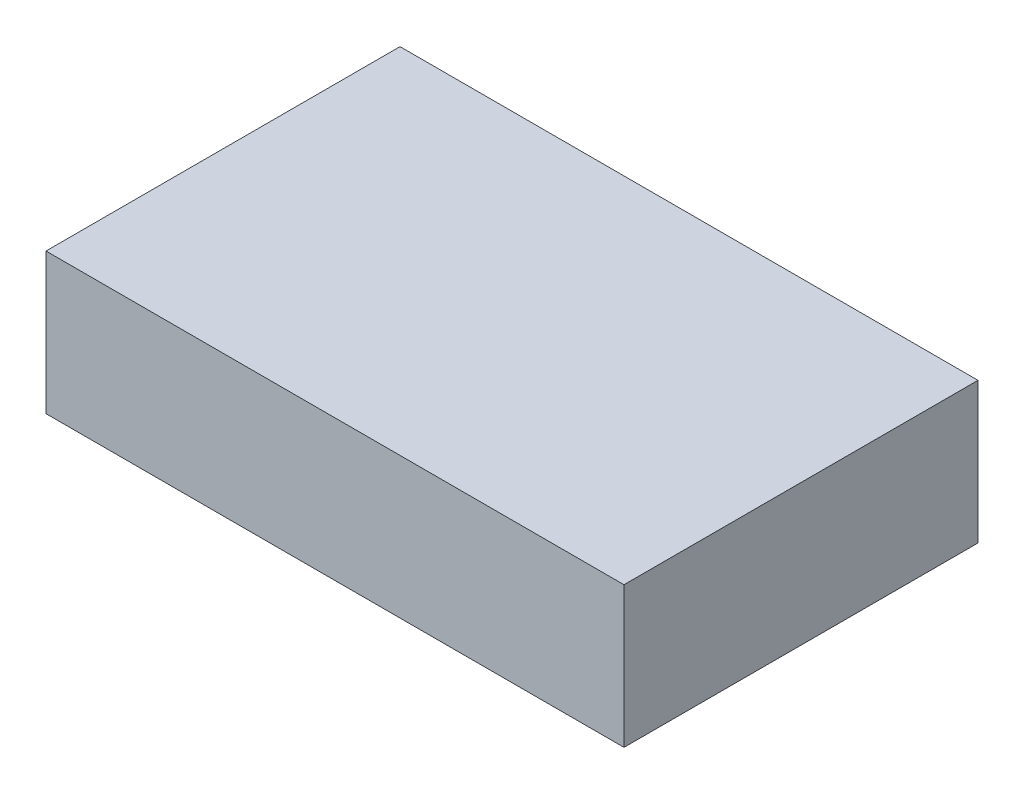
ISO-10303-21;
HEADER;
FILE_DESCRIPTION(('STEP AP214'),'2;1');
FILE_NAME('part.step','',(''),(''),'','','');
FILE_SCHEMA(('AUTOMOTIVE_DESIGN { 1 0 10303 214 1 1 1 1 }'));
ENDSEC;
DATA;
#1=APPLICATION_CONTEXT('core data for automotive mechanical design processes');
#2=APPLICATION_PROTOCOL_DEFINITION('international standard','automotive_design',2000,#1);
#3=PRODUCT_CONTEXT('',#1,'mechanical');
#4=PRODUCT('Part','Part','',(#3));
#5=PRODUCT_RELATED_PRODUCT_CATEGORY('part','',(#4));
#6=PRODUCT_DEFINITION_FORMATION('','',#4);
#7=PRODUCT_DEFINITION_CONTEXT('part definition',#1,'design');
#8=PRODUCT_DEFINITION('design','',#6,#7);
#9=PRODUCT_DEFINITION_SHAPE('','',#8);
#10=(LENGTH_UNIT() NAMED_UNIT(*) SI_UNIT(.MILLI.,.METRE.));
#11=(NAMED_UNIT(*) PLANE_ANGLE_UNIT() SI_UNIT($,.RADIAN.));
#12=(NAMED_UNIT(*) SI_UNIT($,.STERADIAN.) SOLID_ANGLE_UNIT());
#13=UNCERTAINTY_MEASURE_WITH_UNIT(LENGTH_MEASURE(1.E-05),#10,'distance_accuracy_value','');
#14=(GEOMETRIC_REPRESENTATION_CONTEXT(3) GLOBAL_UNCERTAINTY_ASSIGNED_CONTEXT((#13)) GLOBAL_UNIT_ASSIGNED_CONTEXT((#10,
#11,#12)) REPRESENTATION_CONTEXT('',''));
#15=CARTESIAN_POINT('',(0.,0.,0.));
#16=DIRECTION('',(0.,0.,1.));
#17=DIRECTION('',(1.,0.,0.));
#18=AXIS2_PLACEMENT_3D('',#15,#16,#17);
#19=CARTESIAN_POINT('',(80.,39.,49.));
#20=DIRECTION('',(-1.,0.,0.));
#21=DIRECTION('',(0.,0.,1.));
#22=AXIS2_PLACEMENT_3D('',#19,#20,#21);
#23=PLANE('',#22);
#24=DIRECTION('',(0.,0.,-1.));
#25=VECTOR('',#24,1.);
#26=CARTESIAN_POINT('',(80.,0.,49.));
#27=LINE('',#26,#25);
#28=CARTESIAN_POINT('',(80.,0.,49.));
#29=VERTEX_POINT('',#28);
#30=CARTESIAN_POINT('',(80.,0.,-49.));
#31=VERTEX_POINT('',#30);
#32=EDGE_CURVE('E118',#29,#31,#27,.T.);
#33=ORIENTED_EDGE('',*,*,#32,.T.);
#34=DIRECTION('',(0.,-1.,0.));
#35=VECTOR('',#34,1.);
#36=CARTESIAN_POINT('',(80.,39.,-49.));
#37=LINE('',#36,#35);
#38=CARTESIAN_POINT('',(80.,39.,-49.));
#39=VERTEX_POINT('',#38);
#40=EDGE_CURVE('E11',#39,#31,#37,.T.);
#41=ORIENTED_EDGE('',*,*,#40,.F.);
#42=DIRECTION('',(0.,0.,-1.));
#43=VECTOR('',#42,1.);
#44=CARTESIAN_POINT('',(80.,39.,49.));
#45=LINE('',#44,#43);
#46=CARTESIAN_POINT('',(80.,39.,49.));
#47=VERTEX_POINT('',#46);
#48=EDGE_CURVE('E119',#47,#39,#45,.T.);
#49=ORIENTED_EDGE('',*,*,#48,.F.);
#50=DIRECTION('',(0.,-1.,0.));
#51=VECTOR('',#50,1.);
#52=CARTESIAN_POINT('',(80.,39.,49.));
#53=LINE('',#52,#51);
#54=EDGE_CURVE('E129',#47,#29,#53,.T.);
#55=ORIENTED_EDGE('',*,*,#54,.T.);
#56=EDGE_LOOP('',(#33,#41,#49,#55));
#57=FACE_BOUND('',#56,.T.);
#58=ADVANCED_FACE('F38',(#57),#23,.F.);
#59=CARTESIAN_POINT('',(-80.,39.,-49.));
#60=DIRECTION('',(0.,0.,1.));
#61=DIRECTION('',(1.,0.,0.));
#62=AXIS2_PLACEMENT_3D('',#59,#60,#61);
#63=PLANE('',#62);
#64=DIRECTION('',(-1.,0.,0.));
#65=VECTOR('',#64,1.);
#66=CARTESIAN_POINT('',(-80.,0.,-49.));
#67=LINE('',#66,#65);
#68=CARTESIAN_POINT('',(-80.,0.,-49.));
#69=VERTEX_POINT('',#68);
#70=EDGE_CURVE('E133',#31,#69,#67,.T.);
#71=ORIENTED_EDGE('',*,*,#70,.T.);
#72=DIRECTION('',(0.,-1.,0.));
#73=VECTOR('',#72,1.);
#74=CARTESIAN_POINT('',(-80.,39.,-49.));
#75=LINE('',#74,#73);
#76=CARTESIAN_POINT('',(-80.,39.,-49.));
#77=VERTEX_POINT('',#76);
#78=EDGE_CURVE('E47',#77,#69,#75,.T.);
#79=ORIENTED_EDGE('',*,*,#78,.F.);
#80=DIRECTION('',(-1.,0.,0.));
#81=VECTOR('',#80,1.);
#82=CARTESIAN_POINT('',(-80.,39.,-49.));
#83=LINE('',#82,#81);
#84=EDGE_CURVE('E86',#39,#77,#83,.T.);
#85=ORIENTED_EDGE('',*,*,#84,.F.);
#86=ORIENTED_EDGE('',*,*,#40,.T.);
#87=EDGE_LOOP('',(#71,#79,#85,#86));
#88=FACE_BOUND('',#87,.T.);
#89=ADVANCED_FACE('F162',(#88),#63,.F.);
#90=CARTESIAN_POINT('',(-80.,39.,49.));
#91=DIRECTION('',(1.,0.,0.));
#92=DIRECTION('',(0.,0.,-1.));
#93=AXIS2_PLACEMENT_3D('',#90,#91,#92);
#94=PLANE('',#93);
#95=DIRECTION('',(0.,0.,1.));
#96=VECTOR('',#95,1.);
#97=CARTESIAN_POINT('',(-80.,0.,49.));
#98=LINE('',#97,#96);
#99=CARTESIAN_POINT('',(-80.,0.,49.));
#100=VERTEX_POINT('',#99);
#101=EDGE_CURVE('E73',#69,#100,#98,.T.);
#102=ORIENTED_EDGE('',*,*,#101,.T.);
#103=DIRECTION('',(0.,-1.,0.));
#104=VECTOR('',#103,1.);
#105=CARTESIAN_POINT('',(-80.,39.,49.));
#106=LINE('',#105,#104);
#107=CARTESIAN_POINT('',(-80.,39.,49.));
#108=VERTEX_POINT('',#107);
#109=EDGE_CURVE('E142',#108,#100,#106,.T.);
#110=ORIENTED_EDGE('',*,*,#109,.F.);
#111=DIRECTION('',(0.,0.,1.));
#112=VECTOR('',#111,1.);
#113=CARTESIAN_POINT('',(-80.,39.,49.));
#114=LINE('',#113,#112);
#115=EDGE_CURVE('E124',#77,#108,#114,.T.);
#116=ORIENTED_EDGE('',*,*,#115,.F.);
#117=ORIENTED_EDGE('',*,*,#78,.T.);
#118=EDGE_LOOP('',(#102,#110,#116,#117));
#119=FACE_BOUND('',#118,.T.);
#120=ADVANCED_FACE('F146',(#119),#94,.F.);
#121=CARTESIAN_POINT('',(-80.,39.,49.));
#122=DIRECTION('',(0.,0.,-1.));
#123=DIRECTION('',(-1.,0.,0.));
#124=AXIS2_PLACEMENT_3D('',#121,#122,#123);
#125=PLANE('',#124);
#126=DIRECTION('',(1.,0.,0.));
#127=VECTOR('',#126,1.);
#128=CARTESIAN_POINT('',(-80.,0.,49.));
#129=LINE('',#128,#127);
#130=EDGE_CURVE('E79',#100,#29,#129,.T.);
#131=ORIENTED_EDGE('',*,*,#130,.T.);
#132=ORIENTED_EDGE('',*,*,#54,.F.);
#133=DIRECTION('',(1.,0.,0.));
#134=VECTOR('',#133,1.);
#135=CARTESIAN_POINT('',(-80.,39.,49.));
#136=LINE('',#135,#134);
#137=EDGE_CURVE('E55',#108,#47,#136,.T.);
#138=ORIENTED_EDGE('',*,*,#137,.F.);
#139=ORIENTED_EDGE('',*,*,#109,.T.);
#140=EDGE_LOOP('',(#131,#132,#138,#139));
#141=FACE_BOUND('',#140,.T.);
#142=ADVANCED_FACE('F153',(#141),#125,.F.);
#143=CARTESIAN_POINT('',(0.,39.,0.));
#144=DIRECTION('',(0.,-1.,0.));
#145=DIRECTION('',(0.,0.,-1.));
#146=AXIS2_PLACEMENT_3D('',#143,#144,#145);
#147=PLANE('',#146);
#148=ORIENTED_EDGE('',*,*,#48,.T.);
#149=ORIENTED_EDGE('',*,*,#84,.T.);
#150=ORIENTED_EDGE('',*,*,#115,.T.);
#151=ORIENTED_EDGE('',*,*,#137,.T.);
#152=EDGE_LOOP('',(#148,#149,#150,#151));
#153=FACE_BOUND('',#152,.T.);
#154=ADVANCED_FACE('F155',(#153),#147,.F.);
#155=CARTESIAN_POINT('',(0.,0.,0.));
#156=DIRECTION('',(0.,-1.,0.));
#157=DIRECTION('',(0.,0.,-1.));
#158=AXIS2_PLACEMENT_3D('',#155,#156,#157);
#159=PLANE('',#158);
#160=CARTESIAN_POINT('',(75.,0.,-44.));
#161=DIRECTION('',(0.,-1.,0.));
#162=DIRECTION('',(0.,0.,-1.));
#163=AXIS2_PLACEMENT_3D('',#160,#161,#162);
#164=CIRCLE('',#163,1.8);
#165=CARTESIAN_POINT('',(75.,0.,-45.8));
#166=VERTEX_POINT('',#165);
#167=EDGE_CURVE('E105',#166,#166,#164,.T.);
#168=ORIENTED_EDGE('',*,*,#167,.F.);
#169=EDGE_LOOP('',(#168));
#170=FACE_BOUND('',#169,.T.);
#171=CARTESIAN_POINT('',(-77.,0.,43.));
#172=DIRECTION('',(0.,-1.,0.));
#173=DIRECTION('',(0.,0.,-1.));
#174=AXIS2_PLACEMENT_3D('',#171,#172,#173);
#175=CIRCLE('',#174,1.8);
#176=CARTESIAN_POINT('',(-77.,0.,41.2));
#177=VERTEX_POINT('',#176);
#178=EDGE_CURVE('E104',#177,#177,#175,.T.);
#179=ORIENTED_EDGE('',*,*,#178,.F.);
#180=EDGE_LOOP('',(#179));
#181=FACE_BOUND('',#180,.T.);
#182=ORIENTED_EDGE('',*,*,#32,.F.);
#183=ORIENTED_EDGE('',*,*,#130,.F.);
#184=ORIENTED_EDGE('',*,*,#101,.F.);
#185=ORIENTED_EDGE('',*,*,#70,.F.);
#186=EDGE_LOOP('',(#182,#183,#184,#185));
#187=FACE_BOUND('',#186,.T.);
#188=ADVANCED_FACE('F149',(#170,#181,#187),#159,.T.);
#189=CARTESIAN_POINT('',(-77.,20.,43.));
#190=DIRECTION('',(0.,-1.,0.));
#191=DIRECTION('',(0.,0.,-1.));
#192=AXIS2_PLACEMENT_3D('',#189,#190,#191);
#193=CONICAL_SURFACE('',#192,1.8,1.02974425867665);
#194=CARTESIAN_POINT('',(-77.,21.0815491142496,43.));
#195=VERTEX_POINT('',#194);
#196=VERTEX_LOOP('',#195);
#197=FACE_BOUND('',#196,.T.);
#198=CARTESIAN_POINT('',(-77.,20.,43.));
#199=DIRECTION('',(0.,-1.,0.));
#200=DIRECTION('',(0.,0.,-1.));
#201=AXIS2_PLACEMENT_3D('',#198,#199,#200);
#202=CIRCLE('',#201,1.8);
#203=CARTESIAN_POINT('',(-77.,20.,41.2));
#204=VERTEX_POINT('',#203);
#205=EDGE_CURVE('E110',#204,#204,#202,.T.);
#206=ORIENTED_EDGE('',*,*,#205,.T.);
#207=EDGE_LOOP('',(#206));
#208=FACE_BOUND('',#207,.T.);
#209=ADVANCED_FACE('F194',(#197,#208),#193,.F.);
#210=CARTESIAN_POINT('',(-77.,0.,43.));
#211=DIRECTION('',(0.,-1.,0.));
#212=DIRECTION('',(0.,0.,-1.));
#213=AXIS2_PLACEMENT_3D('',#210,#211,#212);
#214=CYLINDRICAL_SURFACE('',#213,1.8);
#215=ORIENTED_EDGE('',*,*,#205,.F.);
#216=EDGE_LOOP('',(#215));
#217=FACE_BOUND('',#216,.T.);
#218=ORIENTED_EDGE('',*,*,#178,.T.);
#219=EDGE_LOOP('',(#218));
#220=FACE_BOUND('',#219,.T.);
#221=ADVANCED_FACE('F97',(#217,#220),#214,.F.);
#222=CARTESIAN_POINT('',(75.,20.,-44.));
#223=DIRECTION('',(0.,-1.,0.));
#224=DIRECTION('',(0.,0.,-1.));
#225=AXIS2_PLACEMENT_3D('',#222,#223,#224);
#226=CONICAL_SURFACE('',#225,1.8,1.02974425867665);
#227=CARTESIAN_POINT('',(75.,21.0815491142496,-44.));
#228=VERTEX_POINT('',#227);
#229=VERTEX_LOOP('',#228);
#230=FACE_BOUND('',#229,.T.);
#231=CARTESIAN_POINT('',(75.,20.,-44.));
#232=DIRECTION('',(0.,-1.,0.));
#233=DIRECTION('',(0.,0.,-1.));
#234=AXIS2_PLACEMENT_3D('',#231,#232,#233);
#235=CIRCLE('',#234,1.8);
#236=CARTESIAN_POINT('',(75.,20.,-45.8));
#237=VERTEX_POINT('',#236);
#238=EDGE_CURVE('E101',#237,#237,#235,.T.);
#239=ORIENTED_EDGE('',*,*,#238,.T.);
#240=EDGE_LOOP('',(#239));
#241=FACE_BOUND('',#240,.T.);
#242=ADVANCED_FACE('F93',(#230,#241),#226,.F.);
#243=CARTESIAN_POINT('',(75.,0.,-44.));
#244=DIRECTION('',(0.,-1.,0.));
#245=DIRECTION('',(0.,0.,-1.));
#246=AXIS2_PLACEMENT_3D('',#243,#244,#245);
#247=CYLINDRICAL_SURFACE('',#246,1.8);
#248=ORIENTED_EDGE('',*,*,#238,.F.);
#249=EDGE_LOOP('',(#248));
#250=FACE_BOUND('',#249,.T.);
#251=ORIENTED_EDGE('',*,*,#167,.T.);
#252=EDGE_LOOP('',(#251));
#253=FACE_BOUND('',#252,.T.);
#254=ADVANCED_FACE('F96',(#250,#253),#247,.F.);
#255=CLOSED_SHELL('',(#58,#89,#120,#142,#154,#188,#209,#221,#242,#254));
#256=MANIFOLD_SOLID_BREP('B2',#255);
#257=ADVANCED_BREP_SHAPE_REPRESENTATION('',(#18,#256),#14);
#258=SHAPE_DEFINITION_REPRESENTATION(#9,#257);
ENDSEC;
END-ISO-10303-21;
